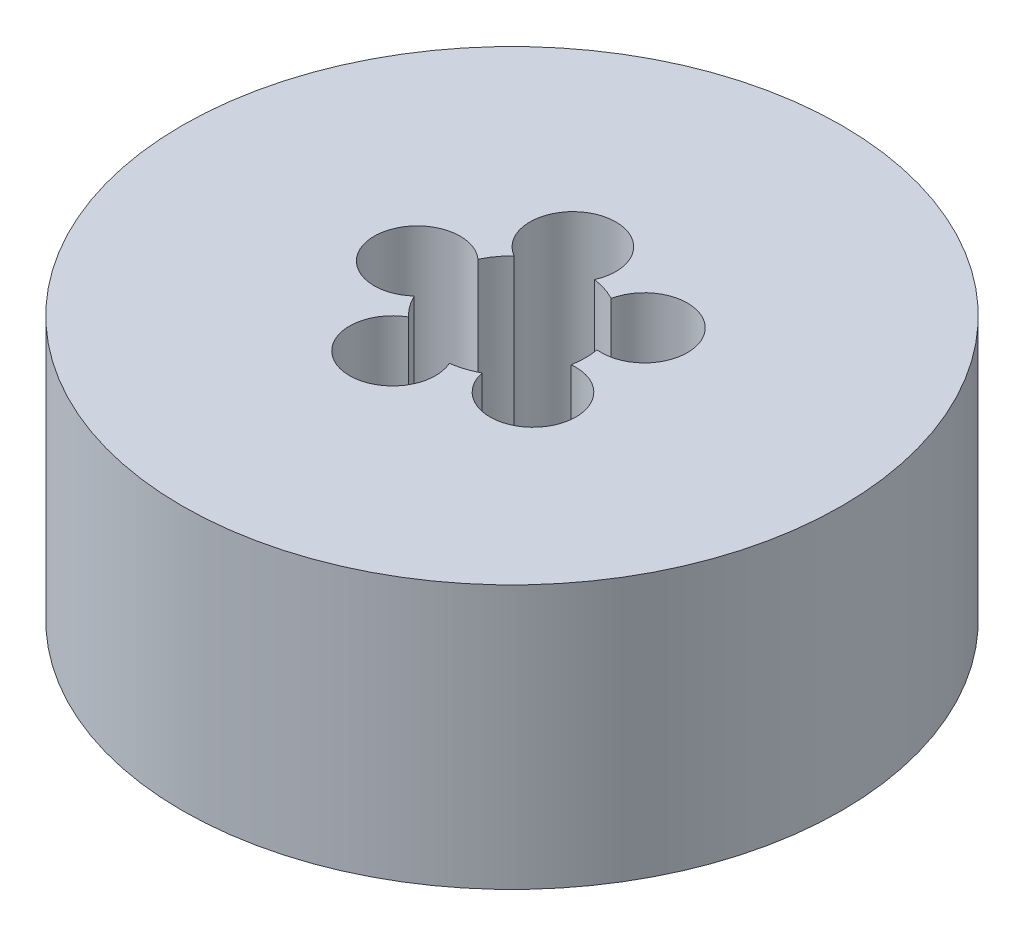
ISO-10303-21;
HEADER;
FILE_DESCRIPTION(('STEP AP214'),'2;1');
FILE_NAME('part.step','',(''),(''),'','','');
FILE_SCHEMA(('AUTOMOTIVE_DESIGN { 1 0 10303 214 1 1 1 1 }'));
ENDSEC;
DATA;
#1=APPLICATION_CONTEXT('core data for automotive mechanical design processes');
#2=APPLICATION_PROTOCOL_DEFINITION('international standard','automotive_design',2000,#1);
#3=PRODUCT_CONTEXT('',#1,'mechanical');
#4=PRODUCT('Part','Part','',(#3));
#5=PRODUCT_RELATED_PRODUCT_CATEGORY('part','',(#4));
#6=PRODUCT_DEFINITION_FORMATION('','',#4);
#7=PRODUCT_DEFINITION_CONTEXT('part definition',#1,'design');
#8=PRODUCT_DEFINITION('design','',#6,#7);
#9=PRODUCT_DEFINITION_SHAPE('','',#8);
#10=(LENGTH_UNIT() NAMED_UNIT(*) SI_UNIT(.MILLI.,.METRE.));
#11=(NAMED_UNIT(*) PLANE_ANGLE_UNIT() SI_UNIT($,.RADIAN.));
#12=(NAMED_UNIT(*) SI_UNIT($,.STERADIAN.) SOLID_ANGLE_UNIT());
#13=UNCERTAINTY_MEASURE_WITH_UNIT(LENGTH_MEASURE(1.E-05),#10,'distance_accuracy_value','');
#14=(GEOMETRIC_REPRESENTATION_CONTEXT(3) GLOBAL_UNCERTAINTY_ASSIGNED_CONTEXT((#13)) GLOBAL_UNIT_ASSIGNED_CONTEXT((#10,
#11,#12)) REPRESENTATION_CONTEXT('',''));
#15=CARTESIAN_POINT('',(0.,0.,0.));
#16=DIRECTION('',(0.,0.,1.));
#17=DIRECTION('',(1.,0.,0.));
#18=AXIS2_PLACEMENT_3D('',#15,#16,#17);
#19=CARTESIAN_POINT('',(0.,18.,0.));
#20=DIRECTION('',(0.,-1.,0.));
#21=DIRECTION('',(0.,0.,-1.));
#22=AXIS2_PLACEMENT_3D('',#19,#20,#21);
#23=CYLINDRICAL_SURFACE('',#22,22.5);
#24=CARTESIAN_POINT('',(0.,18.,0.));
#25=DIRECTION('',(0.,1.,0.));
#26=DIRECTION('',(0.,0.,1.));
#27=AXIS2_PLACEMENT_3D('',#24,#25,#26);
#28=CIRCLE('',#27,22.5);
#29=CARTESIAN_POINT('',(0.,18.,22.5));
#30=VERTEX_POINT('',#29);
#31=EDGE_CURVE('E157',#30,#30,#28,.T.);
#32=ORIENTED_EDGE('',*,*,#31,.F.);
#33=EDGE_LOOP('',(#32));
#34=FACE_BOUND('',#33,.T.);
#35=CARTESIAN_POINT('',(0.,0.,0.));
#36=DIRECTION('',(0.,1.,0.));
#37=DIRECTION('',(0.,0.,1.));
#38=AXIS2_PLACEMENT_3D('',#35,#36,#37);
#39=CIRCLE('',#38,22.5);
#40=CARTESIAN_POINT('',(0.,0.,22.5));
#41=VERTEX_POINT('',#40);
#42=EDGE_CURVE('E150',#41,#41,#39,.T.);
#43=ORIENTED_EDGE('',*,*,#42,.T.);
#44=EDGE_LOOP('',(#43));
#45=FACE_BOUND('',#44,.T.);
#46=ADVANCED_FACE('F39',(#34,#45),#23,.T.);
#47=CARTESIAN_POINT('',(0.,18.,0.));
#48=DIRECTION('',(0.,1.,0.));
#49=DIRECTION('',(0.,0.,1.));
#50=AXIS2_PLACEMENT_3D('',#47,#48,#49);
#51=PLANE('',#50);
#52=CARTESIAN_POINT('',(-1.99932148528902,18.,-6.15327882079455));
#53=DIRECTION('',(0.,1.,0.));
#54=DIRECTION('',(-0.95105651629515,0.,0.309016994374958));
#55=AXIS2_PLACEMENT_3D('',#52,#53,#54);
#56=CIRCLE('',#55,2.93627055221525);
#57=CARTESIAN_POINT('',(0.680625426360471,18.,-4.95345828982052));
#58=VERTEX_POINT('',#57);
#59=CARTESIAN_POINT('',(-3.46220726733179,18.,-3.60737034944222));
#60=VERTEX_POINT('',#59);
#61=EDGE_CURVE('E194',#58,#60,#56,.T.);
#62=ORIENTED_EDGE('',*,*,#61,.F.);
#63=CARTESIAN_POINT('',(0.,18.,0.));
#64=DIRECTION('',(0.,1.,0.));
#65=DIRECTION('',(0.,0.,1.));
#66=AXIS2_PLACEMENT_3D('',#63,#64,#65);
#67=CIRCLE('',#66,5.);
#68=CARTESIAN_POINT('',(2.36093219387299,18.,-4.40749352534227));
#69=VERTEX_POINT('',#68);
#70=EDGE_CURVE('E147',#69,#58,#67,.T.);
#71=ORIENTED_EDGE('',*,*,#70,.F.);
#72=CARTESIAN_POINT('',(5.23429160292436,18.,-3.80293545350597));
#73=DIRECTION('',(0.,1.,0.));
#74=DIRECTION('',(-0.58778525229248,0.,-0.809016994374942));
#75=AXIS2_PLACEMENT_3D('',#72,#73,#74);
#76=CIRCLE('',#75,2.93627055221525);
#77=CARTESIAN_POINT('',(4.92134360827913,18.,-0.883389545585698));
#78=VERTEX_POINT('',#77);
#79=EDGE_CURVE('E254',#78,#69,#76,.T.);
#80=ORIENTED_EDGE('',*,*,#79,.F.);
#81=CARTESIAN_POINT('',(4.92134360827915,18.,0.883389545585627));
#82=VERTEX_POINT('',#81);
#83=EDGE_CURVE('E144',#82,#78,#67,.T.);
#84=ORIENTED_EDGE('',*,*,#83,.F.);
#85=CARTESIAN_POINT('',(5.23429160292442,18.,3.80293545350589));
#86=DIRECTION('',(0.,1.,0.));
#87=DIRECTION('',(0.587785252292469,0.,-0.809016994374951));
#88=AXIS2_PLACEMENT_3D('',#85,#86,#87);
#89=CIRCLE('',#88,2.93627055221525);
#90=CARTESIAN_POINT('',(2.36093219387306,18.,4.40749352534224));
#91=VERTEX_POINT('',#90);
#92=EDGE_CURVE('E141',#91,#82,#89,.T.);
#93=ORIENTED_EDGE('',*,*,#92,.F.);
#94=CARTESIAN_POINT('',(0.680625426360541,18.,4.95345828982051));
#95=VERTEX_POINT('',#94);
#96=EDGE_CURVE('E134',#95,#91,#67,.T.);
#97=ORIENTED_EDGE('',*,*,#96,.F.);
#98=CARTESIAN_POINT('',(-1.99932148528893,18.,6.15327882079458));
#99=DIRECTION('',(0.,1.,0.));
#100=DIRECTION('',(0.951056516295155,0.,0.309016994374945));
#101=AXIS2_PLACEMENT_3D('',#98,#99,#100);
#102=CIRCLE('',#101,2.93627055221525);
#103=CARTESIAN_POINT('',(-3.46220726733174,18.,3.60737034944227));
#104=VERTEX_POINT('',#103);
#105=EDGE_CURVE('E111',#104,#95,#102,.T.);
#106=ORIENTED_EDGE('',*,*,#105,.F.);
#107=CARTESIAN_POINT('',(-4.50069396118095,18.,2.17801603937835));
#108=VERTEX_POINT('',#107);
#109=EDGE_CURVE('E145',#108,#104,#67,.T.);
#110=ORIENTED_EDGE('',*,*,#109,.F.);
#111=CARTESIAN_POINT('',(-6.46994023527089,18.,0.));
#112=DIRECTION('',(0.,1.,0.));
#113=DIRECTION('',(0.,0.,1.));
#114=AXIS2_PLACEMENT_3D('',#111,#112,#113);
#115=CIRCLE('',#114,2.93627055221525);
#116=CARTESIAN_POINT('',(-4.50069396118095,18.,-2.17801603937835));
#117=VERTEX_POINT('',#116);
#118=EDGE_CURVE('E153',#117,#108,#115,.T.);
#119=ORIENTED_EDGE('',*,*,#118,.F.);
#120=EDGE_CURVE('E146',#60,#117,#67,.T.);
#121=ORIENTED_EDGE('',*,*,#120,.F.);
#122=EDGE_LOOP('',(#62,#71,#80,#84,#93,#97,#106,#110,#119,#121));
#123=FACE_BOUND('',#122,.T.);
#124=ORIENTED_EDGE('',*,*,#31,.T.);
#125=EDGE_LOOP('',(#124));
#126=FACE_BOUND('',#125,.T.);
#127=ADVANCED_FACE('F139',(#123,#126),#51,.T.);
#128=CARTESIAN_POINT('',(0.,0.,0.));
#129=DIRECTION('',(0.,1.,0.));
#130=DIRECTION('',(0.,0.,1.));
#131=AXIS2_PLACEMENT_3D('',#128,#129,#130);
#132=PLANE('',#131);
#133=CARTESIAN_POINT('',(0.,0.,0.));
#134=DIRECTION('',(0.,1.,0.));
#135=DIRECTION('',(0.,0.,1.));
#136=AXIS2_PLACEMENT_3D('',#133,#134,#135);
#137=CIRCLE('',#136,5.);
#138=CARTESIAN_POINT('',(0.,0.,5.));
#139=VERTEX_POINT('',#138);
#140=EDGE_CURVE('E154',#139,#139,#137,.T.);
#141=ORIENTED_EDGE('',*,*,#140,.T.);
#142=EDGE_LOOP('',(#141));
#143=FACE_BOUND('',#142,.T.);
#144=ORIENTED_EDGE('',*,*,#42,.F.);
#145=EDGE_LOOP('',(#144));
#146=FACE_BOUND('',#145,.T.);
#147=ADVANCED_FACE('F213',(#143,#146),#132,.F.);
#148=CARTESIAN_POINT('',(0.,18.,0.));
#149=DIRECTION('',(0.,-1.,0.));
#150=DIRECTION('',(0.,0.,-1.));
#151=AXIS2_PLACEMENT_3D('',#148,#149,#150);
#152=CYLINDRICAL_SURFACE('',#151,5.);
#153=DIRECTION('',(0.,1.,0.));
#154=VECTOR('',#153,1.);
#155=CARTESIAN_POINT('',(0.680625426360471,11.7287610489948,-4.95345828982052));
#156=LINE('',#155,#154);
#157=CARTESIAN_POINT('',(0.680625426360471,5.45752209798961,-4.95345828982052));
#158=VERTEX_POINT('',#157);
#159=EDGE_CURVE('E11',#158,#58,#156,.T.);
#160=ORIENTED_EDGE('',*,*,#159,.F.);
#161=CARTESIAN_POINT('',(0.,5.45752209798961,0.));
#162=DIRECTION('',(0.,1.,0.));
#163=DIRECTION('',(0.,0.,1.));
#164=AXIS2_PLACEMENT_3D('',#161,#162,#163);
#165=CIRCLE('',#164,5.);
#166=CARTESIAN_POINT('',(-3.46220726733179,5.45752209798961,-3.60737034944222));
#167=VERTEX_POINT('',#166);
#168=EDGE_CURVE('E189',#158,#167,#165,.T.);
#169=ORIENTED_EDGE('',*,*,#168,.T.);
#170=DIRECTION('',(0.,1.,0.));
#171=VECTOR('',#170,1.);
#172=CARTESIAN_POINT('',(-3.46220726733179,11.7287610489948,-3.60737034944222));
#173=LINE('',#172,#171);
#174=EDGE_CURVE('E46',#60,#167,#173,.F.);
#175=ORIENTED_EDGE('',*,*,#174,.F.);
#176=ORIENTED_EDGE('',*,*,#120,.T.);
#177=DIRECTION('',(0.,1.,0.));
#178=VECTOR('',#177,1.);
#179=CARTESIAN_POINT('',(-4.50069396118095,11.7287610489948,-2.17801603937835));
#180=LINE('',#179,#178);
#181=CARTESIAN_POINT('',(-4.50069396118095,5.45752209798961,-2.17801603937835));
#182=VERTEX_POINT('',#181);
#183=EDGE_CURVE('E168',#182,#117,#180,.T.);
#184=ORIENTED_EDGE('',*,*,#183,.F.);
#185=CARTESIAN_POINT('',(0.,5.45752209798961,0.));
#186=DIRECTION('',(0.,1.,0.));
#187=DIRECTION('',(0.,0.,1.));
#188=AXIS2_PLACEMENT_3D('',#185,#186,#187);
#189=CIRCLE('',#188,5.);
#190=CARTESIAN_POINT('',(-4.50069396118095,5.45752209798961,2.17801603937835));
#191=VERTEX_POINT('',#190);
#192=EDGE_CURVE('E165',#182,#191,#189,.T.);
#193=ORIENTED_EDGE('',*,*,#192,.T.);
#194=DIRECTION('',(0.,1.,0.));
#195=VECTOR('',#194,1.);
#196=CARTESIAN_POINT('',(-4.50069396118095,11.7287610489948,2.17801603937835));
#197=LINE('',#196,#195);
#198=EDGE_CURVE('E170',#108,#191,#197,.F.);
#199=ORIENTED_EDGE('',*,*,#198,.F.);
#200=ORIENTED_EDGE('',*,*,#109,.T.);
#201=DIRECTION('',(0.,1.,0.));
#202=VECTOR('',#201,1.);
#203=CARTESIAN_POINT('',(-3.46220726733174,11.7287610489948,3.60737034944227));
#204=LINE('',#203,#202);
#205=CARTESIAN_POINT('',(-3.46220726733174,5.45752209798961,3.60737034944227));
#206=VERTEX_POINT('',#205);
#207=EDGE_CURVE('E121',#206,#104,#204,.T.);
#208=ORIENTED_EDGE('',*,*,#207,.F.);
#209=CARTESIAN_POINT('',(0.,5.45752209798961,0.));
#210=DIRECTION('',(0.,1.,0.));
#211=DIRECTION('',(0.,0.,1.));
#212=AXIS2_PLACEMENT_3D('',#209,#210,#211);
#213=CIRCLE('',#212,5.);
#214=CARTESIAN_POINT('',(0.680625426360541,5.45752209798961,4.95345828982051));
#215=VERTEX_POINT('',#214);
#216=EDGE_CURVE('E136',#206,#215,#213,.T.);
#217=ORIENTED_EDGE('',*,*,#216,.T.);
#218=DIRECTION('',(0.,1.,0.));
#219=VECTOR('',#218,1.);
#220=CARTESIAN_POINT('',(0.680625426360541,11.7287610489948,4.95345828982051));
#221=LINE('',#220,#219);
#222=EDGE_CURVE('E117',#95,#215,#221,.F.);
#223=ORIENTED_EDGE('',*,*,#222,.F.);
#224=ORIENTED_EDGE('',*,*,#96,.T.);
#225=DIRECTION('',(0.,1.,0.));
#226=VECTOR('',#225,1.);
#227=CARTESIAN_POINT('',(2.36093219387306,11.7287610489948,4.40749352534224));
#228=LINE('',#227,#226);
#229=CARTESIAN_POINT('',(2.36093219387306,5.45752209798961,4.40749352534224));
#230=VERTEX_POINT('',#229);
#231=EDGE_CURVE('E182',#230,#91,#228,.T.);
#232=ORIENTED_EDGE('',*,*,#231,.F.);
#233=CARTESIAN_POINT('',(0.,5.45752209798961,0.));
#234=DIRECTION('',(0.,1.,0.));
#235=DIRECTION('',(0.,0.,1.));
#236=AXIS2_PLACEMENT_3D('',#233,#234,#235);
#237=CIRCLE('',#236,5.);
#238=CARTESIAN_POINT('',(4.92134360827915,5.45752209798961,0.883389545585627));
#239=VERTEX_POINT('',#238);
#240=EDGE_CURVE('E174',#230,#239,#237,.T.);
#241=ORIENTED_EDGE('',*,*,#240,.T.);
#242=DIRECTION('',(0.,1.,0.));
#243=VECTOR('',#242,1.);
#244=CARTESIAN_POINT('',(4.92134360827915,11.7287610489948,0.883389545585628));
#245=LINE('',#244,#243);
#246=EDGE_CURVE('E177',#82,#239,#245,.F.);
#247=ORIENTED_EDGE('',*,*,#246,.F.);
#248=ORIENTED_EDGE('',*,*,#83,.T.);
#249=DIRECTION('',(0.,1.,0.));
#250=VECTOR('',#249,1.);
#251=CARTESIAN_POINT('',(4.92134360827913,11.7287610489948,-0.883389545585698));
#252=LINE('',#251,#250);
#253=CARTESIAN_POINT('',(4.92134360827913,5.45752209798961,-0.883389545585698));
#254=VERTEX_POINT('',#253);
#255=EDGE_CURVE('E187',#254,#78,#252,.T.);
#256=ORIENTED_EDGE('',*,*,#255,.F.);
#257=CARTESIAN_POINT('',(0.,5.45752209798961,0.));
#258=DIRECTION('',(0.,1.,0.));
#259=DIRECTION('',(0.,0.,1.));
#260=AXIS2_PLACEMENT_3D('',#257,#258,#259);
#261=CIRCLE('',#260,5.);
#262=CARTESIAN_POINT('',(2.36093219387299,5.45752209798961,-4.40749352534227));
#263=VERTEX_POINT('',#262);
#264=EDGE_CURVE('E181',#254,#263,#261,.T.);
#265=ORIENTED_EDGE('',*,*,#264,.T.);
#266=DIRECTION('',(0.,1.,0.));
#267=VECTOR('',#266,1.);
#268=CARTESIAN_POINT('',(2.36093219387299,11.7287610489948,-4.40749352534227));
#269=LINE('',#268,#267);
#270=EDGE_CURVE('E186',#69,#263,#269,.F.);
#271=ORIENTED_EDGE('',*,*,#270,.F.);
#272=ORIENTED_EDGE('',*,*,#70,.T.);
#273=EDGE_LOOP('',(#160,#169,#175,#176,#184,#193,#199,#200,#208,#217,#223,#224,#232,#241,#247,
#248,#256,#265,#271,#272));
#274=FACE_BOUND('',#273,.T.);
#275=ORIENTED_EDGE('',*,*,#140,.F.);
#276=EDGE_LOOP('',(#275));
#277=FACE_BOUND('',#276,.T.);
#278=ADVANCED_FACE('F135',(#274,#277),#152,.F.);
#279=CARTESIAN_POINT('',(-6.46994023527089,5.45752209798961,0.));
#280=DIRECTION('',(0.,1.,0.));
#281=DIRECTION('',(0.,0.,1.));
#282=AXIS2_PLACEMENT_3D('',#279,#280,#281);
#283=CYLINDRICAL_SURFACE('',#282,2.93627055221525);
#284=ORIENTED_EDGE('',*,*,#183,.T.);
#285=ORIENTED_EDGE('',*,*,#118,.T.);
#286=ORIENTED_EDGE('',*,*,#198,.T.);
#287=CARTESIAN_POINT('',(-6.46994023527089,5.45752209798961,0.));
#288=DIRECTION('',(0.,1.,0.));
#289=DIRECTION('',(0.,0.,1.));
#290=AXIS2_PLACEMENT_3D('',#287,#288,#289);
#291=CIRCLE('',#290,2.93627055221525);
#292=EDGE_CURVE('E158',#182,#191,#291,.T.);
#293=ORIENTED_EDGE('',*,*,#292,.F.);
#294=EDGE_LOOP('',(#284,#285,#286,#293));
#295=FACE_BOUND('',#294,.T.);
#296=ADVANCED_FACE('F221',(#295),#283,.F.);
#297=CARTESIAN_POINT('',(-6.46994023527089,5.45752209798961,0.));
#298=DIRECTION('',(0.,1.,0.));
#299=DIRECTION('',(0.,0.,1.));
#300=AXIS2_PLACEMENT_3D('',#297,#298,#299);
#301=PLANE('',#300);
#302=ORIENTED_EDGE('',*,*,#292,.T.);
#303=ORIENTED_EDGE('',*,*,#192,.F.);
#304=EDGE_LOOP('',(#302,#303));
#305=FACE_BOUND('',#304,.T.);
#306=ADVANCED_FACE('F227',(#305),#301,.T.);
#307=CARTESIAN_POINT('',(-1.99932148528893,5.45752209798961,6.15327882079458));
#308=DIRECTION('',(0.,1.,0.));
#309=DIRECTION('',(0.,0.,1.));
#310=AXIS2_PLACEMENT_3D('',#307,#308,#309);
#311=CYLINDRICAL_SURFACE('',#310,2.93627055221525);
#312=ORIENTED_EDGE('',*,*,#207,.T.);
#313=ORIENTED_EDGE('',*,*,#105,.T.);
#314=ORIENTED_EDGE('',*,*,#222,.T.);
#315=CARTESIAN_POINT('',(-1.99932148528893,5.45752209798961,6.15327882079458));
#316=DIRECTION('',(0.,1.,0.));
#317=DIRECTION('',(0.951056516295155,0.,0.309016994374945));
#318=AXIS2_PLACEMENT_3D('',#315,#316,#317);
#319=CIRCLE('',#318,2.93627055221525);
#320=EDGE_CURVE('E127',#206,#215,#319,.T.);
#321=ORIENTED_EDGE('',*,*,#320,.F.);
#322=EDGE_LOOP('',(#312,#313,#314,#321));
#323=FACE_BOUND('',#322,.T.);
#324=ADVANCED_FACE('F116',(#323),#311,.F.);
#325=CARTESIAN_POINT('',(-1.99932148528893,5.45752209798961,6.15327882079458));
#326=DIRECTION('',(0.,1.,0.));
#327=DIRECTION('',(0.951056516295155,0.,0.309016994374945));
#328=AXIS2_PLACEMENT_3D('',#325,#326,#327);
#329=PLANE('',#328);
#330=ORIENTED_EDGE('',*,*,#320,.T.);
#331=ORIENTED_EDGE('',*,*,#216,.F.);
#332=EDGE_LOOP('',(#330,#331));
#333=FACE_BOUND('',#332,.T.);
#334=ADVANCED_FACE('F234',(#333),#329,.T.);
#335=CARTESIAN_POINT('',(5.23429160292442,5.45752209798961,3.80293545350589));
#336=DIRECTION('',(0.,1.,0.));
#337=DIRECTION('',(0.,0.,1.));
#338=AXIS2_PLACEMENT_3D('',#335,#336,#337);
#339=CYLINDRICAL_SURFACE('',#338,2.93627055221525);
#340=ORIENTED_EDGE('',*,*,#231,.T.);
#341=ORIENTED_EDGE('',*,*,#92,.T.);
#342=ORIENTED_EDGE('',*,*,#246,.T.);
#343=CARTESIAN_POINT('',(5.23429160292442,5.45752209798961,3.80293545350589));
#344=DIRECTION('',(0.,1.,0.));
#345=DIRECTION('',(0.587785252292469,0.,-0.809016994374951));
#346=AXIS2_PLACEMENT_3D('',#343,#344,#345);
#347=CIRCLE('',#346,2.93627055221525);
#348=EDGE_CURVE('E130',#230,#239,#347,.T.);
#349=ORIENTED_EDGE('',*,*,#348,.F.);
#350=EDGE_LOOP('',(#340,#341,#342,#349));
#351=FACE_BOUND('',#350,.T.);
#352=ADVANCED_FACE('F240',(#351),#339,.F.);
#353=CARTESIAN_POINT('',(5.23429160292442,5.45752209798961,3.80293545350589));
#354=DIRECTION('',(0.,1.,0.));
#355=DIRECTION('',(0.587785252292469,0.,-0.809016994374951));
#356=AXIS2_PLACEMENT_3D('',#353,#354,#355);
#357=PLANE('',#356);
#358=ORIENTED_EDGE('',*,*,#348,.T.);
#359=ORIENTED_EDGE('',*,*,#240,.F.);
#360=EDGE_LOOP('',(#358,#359));
#361=FACE_BOUND('',#360,.T.);
#362=ADVANCED_FACE('F245',(#361),#357,.T.);
#363=CARTESIAN_POINT('',(5.23429160292436,5.45752209798961,-3.80293545350597));
#364=DIRECTION('',(0.,1.,0.));
#365=DIRECTION('',(0.,0.,1.));
#366=AXIS2_PLACEMENT_3D('',#363,#364,#365);
#367=CYLINDRICAL_SURFACE('',#366,2.93627055221525);
#368=ORIENTED_EDGE('',*,*,#255,.T.);
#369=ORIENTED_EDGE('',*,*,#79,.T.);
#370=ORIENTED_EDGE('',*,*,#270,.T.);
#371=CARTESIAN_POINT('',(5.23429160292436,5.45752209798961,-3.80293545350597));
#372=DIRECTION('',(0.,1.,0.));
#373=DIRECTION('',(-0.58778525229248,0.,-0.809016994374942));
#374=AXIS2_PLACEMENT_3D('',#371,#372,#373);
#375=CIRCLE('',#374,2.93627055221525);
#376=EDGE_CURVE('E56',#254,#263,#375,.T.);
#377=ORIENTED_EDGE('',*,*,#376,.F.);
#378=EDGE_LOOP('',(#368,#369,#370,#377));
#379=FACE_BOUND('',#378,.T.);
#380=ADVANCED_FACE('F266',(#379),#367,.F.);
#381=CARTESIAN_POINT('',(5.23429160292436,5.45752209798961,-3.80293545350597));
#382=DIRECTION('',(0.,1.,0.));
#383=DIRECTION('',(-0.58778525229248,0.,-0.809016994374942));
#384=AXIS2_PLACEMENT_3D('',#381,#382,#383);
#385=PLANE('',#384);
#386=ORIENTED_EDGE('',*,*,#376,.T.);
#387=ORIENTED_EDGE('',*,*,#264,.F.);
#388=EDGE_LOOP('',(#386,#387));
#389=FACE_BOUND('',#388,.T.);
#390=ADVANCED_FACE('F204',(#389),#385,.T.);
#391=CARTESIAN_POINT('',(-1.99932148528902,5.45752209798961,-6.15327882079455));
#392=DIRECTION('',(0.,1.,0.));
#393=DIRECTION('',(0.,0.,1.));
#394=AXIS2_PLACEMENT_3D('',#391,#392,#393);
#395=CYLINDRICAL_SURFACE('',#394,2.93627055221525);
#396=ORIENTED_EDGE('',*,*,#159,.T.);
#397=ORIENTED_EDGE('',*,*,#61,.T.);
#398=ORIENTED_EDGE('',*,*,#174,.T.);
#399=CARTESIAN_POINT('',(-1.99932148528902,5.45752209798961,-6.15327882079455));
#400=DIRECTION('',(0.,1.,0.));
#401=DIRECTION('',(-0.95105651629515,0.,0.309016994374958));
#402=AXIS2_PLACEMENT_3D('',#399,#400,#401);
#403=CIRCLE('',#402,2.93627055221525);
#404=EDGE_CURVE('E55',#158,#167,#403,.T.);
#405=ORIENTED_EDGE('',*,*,#404,.F.);
#406=EDGE_LOOP('',(#396,#397,#398,#405));
#407=FACE_BOUND('',#406,.T.);
#408=ADVANCED_FACE('F193',(#407),#395,.F.);
#409=CARTESIAN_POINT('',(-1.99932148528902,5.45752209798961,-6.15327882079455));
#410=DIRECTION('',(0.,1.,0.));
#411=DIRECTION('',(-0.95105651629515,0.,0.309016994374958));
#412=AXIS2_PLACEMENT_3D('',#409,#410,#411);
#413=PLANE('',#412);
#414=ORIENTED_EDGE('',*,*,#404,.T.);
#415=ORIENTED_EDGE('',*,*,#168,.F.);
#416=EDGE_LOOP('',(#414,#415));
#417=FACE_BOUND('',#416,.T.);
#418=ADVANCED_FACE('F196',(#417),#413,.T.);
#419=CLOSED_SHELL('',(#46,#127,#147,#278,#296,#306,#324,#334,#352,#362,#380,#390,#408,#418));
#420=MANIFOLD_SOLID_BREP('B2',#419);
#421=ADVANCED_BREP_SHAPE_REPRESENTATION('',(#18,#420),#14);
#422=SHAPE_DEFINITION_REPRESENTATION(#9,#421);
ENDSEC;
END-ISO-10303-21;
